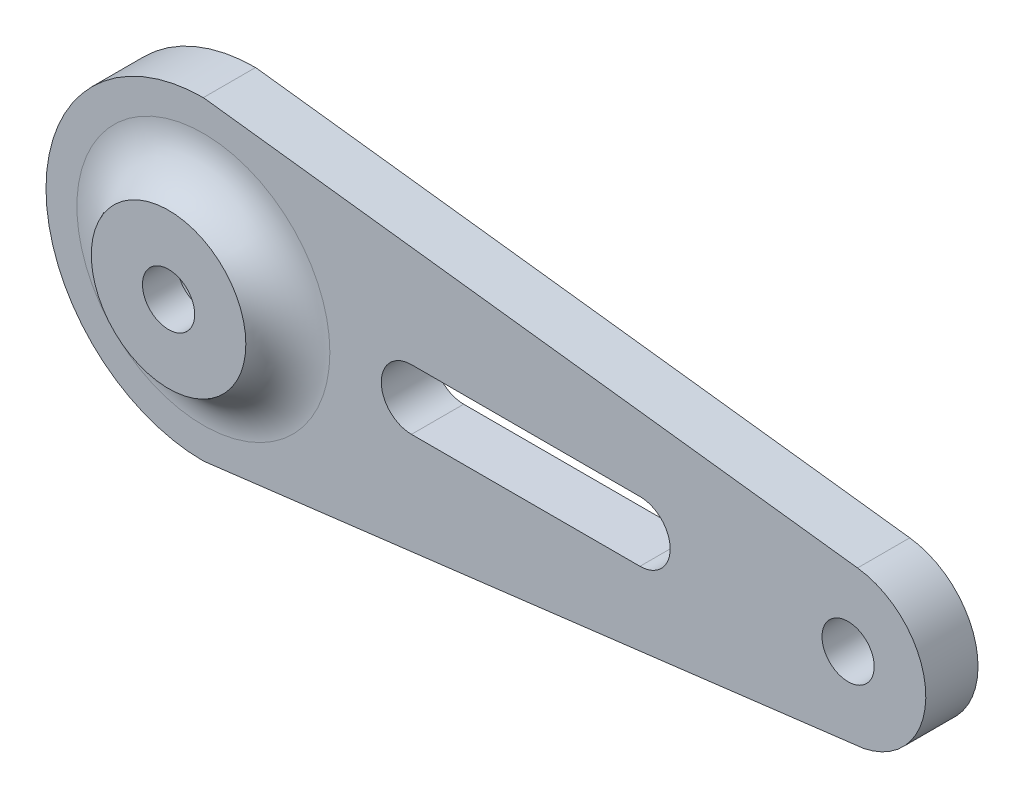
ISO-10303-21;
HEADER;
FILE_DESCRIPTION(('STEP AP214'),'2;1');
FILE_NAME('part.step','',(''),(''),'','','');
FILE_SCHEMA(('AUTOMOTIVE_DESIGN { 1 0 10303 214 1 1 1 1 }'));
ENDSEC;
DATA;
#1=APPLICATION_CONTEXT('core data for automotive mechanical design processes');
#2=APPLICATION_PROTOCOL_DEFINITION('international standard','automotive_design',2000,#1);
#3=PRODUCT_CONTEXT('',#1,'mechanical');
#4=PRODUCT('Part','Part','',(#3));
#5=PRODUCT_RELATED_PRODUCT_CATEGORY('part','',(#4));
#6=PRODUCT_DEFINITION_FORMATION('','',#4);
#7=PRODUCT_DEFINITION_CONTEXT('part definition',#1,'design');
#8=PRODUCT_DEFINITION('design','',#6,#7);
#9=PRODUCT_DEFINITION_SHAPE('','',#8);
#10=(LENGTH_UNIT() NAMED_UNIT(*) SI_UNIT(.MILLI.,.METRE.));
#11=(NAMED_UNIT(*) PLANE_ANGLE_UNIT() SI_UNIT($,.RADIAN.));
#12=(NAMED_UNIT(*) SI_UNIT($,.STERADIAN.) SOLID_ANGLE_UNIT());
#13=UNCERTAINTY_MEASURE_WITH_UNIT(LENGTH_MEASURE(1.E-05),#10,'distance_accuracy_value','');
#14=(GEOMETRIC_REPRESENTATION_CONTEXT(3) GLOBAL_UNCERTAINTY_ASSIGNED_CONTEXT((#13)) GLOBAL_UNIT_ASSIGNED_CONTEXT((#10,
#11,#12)) REPRESENTATION_CONTEXT('',''));
#15=CARTESIAN_POINT('',(0.,0.,0.));
#16=DIRECTION('',(0.,0.,1.));
#17=DIRECTION('',(1.,0.,0.));
#18=AXIS2_PLACEMENT_3D('',#15,#16,#17);
#19=CARTESIAN_POINT('',(-12.9121005284629,104.943544624177,3.));
#20=DIRECTION('',(-0.122117674057894,0.992515628936235,0.));
#21=DIRECTION('',(-0.992515628936235,-0.122117674057894,0.));
#22=AXIS2_PLACEMENT_3D('',#19,#20,#21);
#23=PLANE('',#22);
#24=DIRECTION('',(0.992515628936235,0.122117674057894,0.));
#25=VECTOR('',#24,1.);
#26=CARTESIAN_POINT('',(-12.9121005284629,104.943544624177,0.));
#27=LINE('',#26,#25);
#28=CARTESIAN_POINT('',(-70.9057277691054,97.8080933906298,0.));
#29=VERTEX_POINT('',#28);
#30=CARTESIAN_POINT('',(-32.9565694582331,102.477302429026,0.));
#31=VERTEX_POINT('',#30);
#32=EDGE_CURVE('E154',#29,#31,#27,.T.);
#33=ORIENTED_EDGE('',*,*,#32,.T.);
#34=DIRECTION('',(0.,0.,-1.));
#35=VECTOR('',#34,1.);
#36=CARTESIAN_POINT('',(-32.9565694582331,102.477302429026,3.));
#37=LINE('',#36,#35);
#38=CARTESIAN_POINT('',(-32.9565694582331,102.477302429026,3.));
#39=VERTEX_POINT('',#38);
#40=EDGE_CURVE('E49',#39,#31,#37,.T.);
#41=ORIENTED_EDGE('',*,*,#40,.F.);
#42=DIRECTION('',(0.992515628936235,0.122117674057894,0.));
#43=VECTOR('',#42,1.);
#44=CARTESIAN_POINT('',(-12.9121005284629,104.943544624177,3.));
#45=LINE('',#44,#43);
#46=CARTESIAN_POINT('',(-70.9057277691054,97.8080933906298,3.));
#47=VERTEX_POINT('',#46);
#48=EDGE_CURVE('E116',#47,#39,#45,.T.);
#49=ORIENTED_EDGE('',*,*,#48,.F.);
#50=DIRECTION('',(0.,0.,-1.));
#51=VECTOR('',#50,1.);
#52=CARTESIAN_POINT('',(-70.9057277691054,97.8080933906298,3.));
#53=LINE('',#52,#51);
#54=EDGE_CURVE('E162',#47,#29,#53,.T.);
#55=ORIENTED_EDGE('',*,*,#54,.T.);
#56=EDGE_LOOP('',(#33,#41,#49,#55));
#57=FACE_BOUND('',#56,.T.);
#58=ADVANCED_FACE('F40',(#57),#23,.F.);
#59=CARTESIAN_POINT('',(-33.8600208407276,106.850502785429,3.));
#60=DIRECTION('',(0.,0.,-1.));
#61=DIRECTION('',(-1.,0.,0.));
#62=AXIS2_PLACEMENT_3D('',#59,#60,#61);
#63=CYLINDRICAL_SURFACE('',#62,4.46554652397416);
#64=CARTESIAN_POINT('',(-33.8600208407276,106.850502785429,0.));
#65=DIRECTION('',(0.,0.,1.));
#66=DIRECTION('',(1.,0.,0.));
#67=AXIS2_PLACEMENT_3D('',#64,#65,#66);
#68=CIRCLE('',#67,4.46554652397416);
#69=CARTESIAN_POINT('',(-33.3164248488343,111.282839545579,0.));
#70=VERTEX_POINT('',#69);
#71=EDGE_CURVE('E124',#31,#70,#68,.T.);
#72=ORIENTED_EDGE('',*,*,#71,.T.);
#73=DIRECTION('',(0.,0.,-1.));
#74=VECTOR('',#73,1.);
#75=CARTESIAN_POINT('',(-33.3164248488343,111.282839545579,3.));
#76=LINE('',#75,#74);
#77=CARTESIAN_POINT('',(-33.3164248488343,111.282839545579,3.));
#78=VERTEX_POINT('',#77);
#79=EDGE_CURVE('E122',#78,#70,#76,.T.);
#80=ORIENTED_EDGE('',*,*,#79,.F.);
#81=CARTESIAN_POINT('',(-33.8600208407276,106.850502785429,3.));
#82=DIRECTION('',(0.,0.,1.));
#83=DIRECTION('',(1.,0.,0.));
#84=AXIS2_PLACEMENT_3D('',#81,#82,#83);
#85=CIRCLE('',#84,4.46554652397416);
#86=EDGE_CURVE('E110',#39,#78,#85,.T.);
#87=ORIENTED_EDGE('',*,*,#86,.F.);
#88=ORIENTED_EDGE('',*,*,#40,.T.);
#89=EDGE_LOOP('',(#72,#80,#87,#88));
#90=FACE_BOUND('',#89,.T.);
#91=ADVANCED_FACE('F123',(#90),#63,.T.);
#92=CARTESIAN_POINT('',(12.95214226126,105.60831412192,3.));
#93=DIRECTION('',(0.1217311227136,0.992563113239096,0.));
#94=DIRECTION('',(-0.992563113239096,0.1217311227136,0.));
#95=AXIS2_PLACEMENT_3D('',#92,#93,#94);
#96=PLANE('',#95);
#97=DIRECTION('',(0.992563113239096,-0.1217311227136,0.));
#98=VECTOR('',#97,1.);
#99=CARTESIAN_POINT('',(12.95214226126,105.60831412192,0.));
#100=LINE('',#99,#98);
#101=CARTESIAN_POINT('',(-70.9057277691054,115.892912180229,0.));
#102=VERTEX_POINT('',#101);
#103=EDGE_CURVE('E158',#102,#70,#100,.T.);
#104=ORIENTED_EDGE('',*,*,#103,.F.);
#105=DIRECTION('',(0.,0.,-1.));
#106=VECTOR('',#105,1.);
#107=CARTESIAN_POINT('',(-70.9057277691054,115.892912180229,3.));
#108=LINE('',#107,#106);
#109=CARTESIAN_POINT('',(-70.9057277691054,115.892912180229,3.));
#110=VERTEX_POINT('',#109);
#111=EDGE_CURVE('E85',#110,#102,#108,.T.);
#112=ORIENTED_EDGE('',*,*,#111,.F.);
#113=DIRECTION('',(0.992563113239096,-0.1217311227136,0.));
#114=VECTOR('',#113,1.);
#115=CARTESIAN_POINT('',(12.95214226126,105.60831412192,3.));
#116=LINE('',#115,#114);
#117=EDGE_CURVE('E114',#110,#78,#116,.T.);
#118=ORIENTED_EDGE('',*,*,#117,.T.);
#119=ORIENTED_EDGE('',*,*,#79,.T.);
#120=EDGE_LOOP('',(#104,#112,#118,#119));
#121=FACE_BOUND('',#120,.T.);
#122=ADVANCED_FACE('F129',(#121),#96,.T.);
#123=CARTESIAN_POINT('',(-58.9483057761577,106.850502785429,3.));
#124=DIRECTION('',(0.,0.,-1.));
#125=DIRECTION('',(-1.,0.,0.));
#126=AXIS2_PLACEMENT_3D('',#123,#124,#125);
#127=CYLINDRICAL_SURFACE('',#126,1.73455382707077);
#128=CARTESIAN_POINT('',(-58.9483057761577,106.850502785429,0.));
#129=DIRECTION('',(0.,0.,1.));
#130=DIRECTION('',(1.,0.,0.));
#131=AXIS2_PLACEMENT_3D('',#128,#129,#130);
#132=CIRCLE('',#131,1.73455382707077);
#133=CARTESIAN_POINT('',(-58.9483057761577,108.5850566125,0.));
#134=VERTEX_POINT('',#133);
#135=CARTESIAN_POINT('',(-58.9483057761577,105.115948958358,0.));
#136=VERTEX_POINT('',#135);
#137=EDGE_CURVE('E135',#134,#136,#132,.T.);
#138=ORIENTED_EDGE('',*,*,#137,.F.);
#139=DIRECTION('',(0.,0.,-1.));
#140=VECTOR('',#139,1.);
#141=CARTESIAN_POINT('',(-58.9483057761577,108.5850566125,3.));
#142=LINE('',#141,#140);
#143=CARTESIAN_POINT('',(-58.9483057761577,108.5850566125,3.));
#144=VERTEX_POINT('',#143);
#145=EDGE_CURVE('E96',#144,#134,#142,.T.);
#146=ORIENTED_EDGE('',*,*,#145,.F.);
#147=CARTESIAN_POINT('',(-58.9483057761577,106.850502785429,3.));
#148=DIRECTION('',(0.,0.,1.));
#149=DIRECTION('',(1.,0.,0.));
#150=AXIS2_PLACEMENT_3D('',#147,#148,#149);
#151=CIRCLE('',#150,1.73455382707077);
#152=CARTESIAN_POINT('',(-58.9483057761577,105.115948958358,3.));
#153=VERTEX_POINT('',#152);
#154=EDGE_CURVE('E161',#144,#153,#151,.T.);
#155=ORIENTED_EDGE('',*,*,#154,.T.);
#156=DIRECTION('',(0.,0.,-1.));
#157=VECTOR('',#156,1.);
#158=CARTESIAN_POINT('',(-58.9483057761577,105.115948958358,3.));
#159=LINE('',#158,#157);
#160=EDGE_CURVE('E131',#153,#136,#159,.T.);
#161=ORIENTED_EDGE('',*,*,#160,.T.);
#162=EDGE_LOOP('',(#138,#146,#155,#161));
#163=FACE_BOUND('',#162,.T.);
#164=ADVANCED_FACE('F176',(#163),#127,.F.);
#165=CARTESIAN_POINT('',(0.,108.5850566125,3.));
#166=DIRECTION('',(0.,-1.,0.));
#167=DIRECTION('',(0.,0.,-1.));
#168=AXIS2_PLACEMENT_3D('',#165,#166,#167);
#169=PLANE('',#168);
#170=DIRECTION('',(-1.,0.,0.));
#171=VECTOR('',#170,1.);
#172=CARTESIAN_POINT('',(0.,108.5850566125,0.));
#173=LINE('',#172,#171);
#174=CARTESIAN_POINT('',(-45.8174428336752,108.5850566125,0.));
#175=VERTEX_POINT('',#174);
#176=EDGE_CURVE('E138',#175,#134,#173,.T.);
#177=ORIENTED_EDGE('',*,*,#176,.F.);
#178=DIRECTION('',(0.,0.,-1.));
#179=VECTOR('',#178,1.);
#180=CARTESIAN_POINT('',(-45.8174428336752,108.5850566125,3.));
#181=LINE('',#180,#179);
#182=CARTESIAN_POINT('',(-45.8174428336752,108.5850566125,3.));
#183=VERTEX_POINT('',#182);
#184=EDGE_CURVE('E169',#183,#175,#181,.T.);
#185=ORIENTED_EDGE('',*,*,#184,.F.);
#186=DIRECTION('',(-1.,0.,0.));
#187=VECTOR('',#186,1.);
#188=CARTESIAN_POINT('',(0.,108.5850566125,3.));
#189=LINE('',#188,#187);
#190=EDGE_CURVE('E175',#183,#144,#189,.T.);
#191=ORIENTED_EDGE('',*,*,#190,.T.);
#192=ORIENTED_EDGE('',*,*,#145,.T.);
#193=EDGE_LOOP('',(#177,#185,#191,#192));
#194=FACE_BOUND('',#193,.T.);
#195=ADVANCED_FACE('F173',(#194),#169,.T.);
#196=CARTESIAN_POINT('',(-45.8174428336752,106.850502785429,3.));
#197=DIRECTION('',(0.,0.,-1.));
#198=DIRECTION('',(-1.,0.,0.));
#199=AXIS2_PLACEMENT_3D('',#196,#197,#198);
#200=CYLINDRICAL_SURFACE('',#199,1.73455382707077);
#201=CARTESIAN_POINT('',(-45.8174428336752,106.850502785429,0.));
#202=DIRECTION('',(0.,0.,1.));
#203=DIRECTION('',(1.,0.,0.));
#204=AXIS2_PLACEMENT_3D('',#201,#202,#203);
#205=CIRCLE('',#204,1.73455382707077);
#206=CARTESIAN_POINT('',(-45.8174428336752,105.115948958358,0.));
#207=VERTEX_POINT('',#206);
#208=EDGE_CURVE('E142',#207,#175,#205,.T.);
#209=ORIENTED_EDGE('',*,*,#208,.F.);
#210=DIRECTION('',(0.,0.,-1.));
#211=VECTOR('',#210,1.);
#212=CARTESIAN_POINT('',(-45.8174428336752,105.115948958358,3.));
#213=LINE('',#212,#211);
#214=CARTESIAN_POINT('',(-45.8174428336752,105.115948958358,3.));
#215=VERTEX_POINT('',#214);
#216=EDGE_CURVE('E167',#215,#207,#213,.T.);
#217=ORIENTED_EDGE('',*,*,#216,.F.);
#218=CARTESIAN_POINT('',(-45.8174428336752,106.850502785429,3.));
#219=DIRECTION('',(0.,0.,1.));
#220=DIRECTION('',(1.,0.,0.));
#221=AXIS2_PLACEMENT_3D('',#218,#219,#220);
#222=CIRCLE('',#221,1.73455382707077);
#223=EDGE_CURVE('E188',#215,#183,#222,.T.);
#224=ORIENTED_EDGE('',*,*,#223,.T.);
#225=ORIENTED_EDGE('',*,*,#184,.T.);
#226=EDGE_LOOP('',(#209,#217,#224,#225));
#227=FACE_BOUND('',#226,.T.);
#228=ADVANCED_FACE('F184',(#227),#200,.F.);
#229=CARTESIAN_POINT('',(-33.8600208407276,106.850502785429,3.));
#230=DIRECTION('',(0.,0.,-1.));
#231=DIRECTION('',(-1.,0.,0.));
#232=AXIS2_PLACEMENT_3D('',#229,#230,#231);
#233=CYLINDRICAL_SURFACE('',#232,1.5);
#234=CARTESIAN_POINT('',(-33.8600208407276,106.850502785429,3.));
#235=DIRECTION('',(0.,0.,1.));
#236=DIRECTION('',(1.,0.,0.));
#237=AXIS2_PLACEMENT_3D('',#234,#235,#236);
#238=CIRCLE('',#237,1.5);
#239=CARTESIAN_POINT('',(-32.3600208407275,106.850502785429,3.));
#240=VERTEX_POINT('',#239);
#241=EDGE_CURVE('E198',#240,#240,#238,.T.);
#242=ORIENTED_EDGE('',*,*,#241,.T.);
#243=EDGE_LOOP('',(#242));
#244=FACE_BOUND('',#243,.T.);
#245=CARTESIAN_POINT('',(-33.8600208407276,106.850502785429,0.));
#246=DIRECTION('',(0.,0.,1.));
#247=DIRECTION('',(1.,0.,0.));
#248=AXIS2_PLACEMENT_3D('',#245,#246,#247);
#249=CIRCLE('',#248,1.5);
#250=CARTESIAN_POINT('',(-32.3600208407275,106.850502785429,0.));
#251=VERTEX_POINT('',#250);
#252=EDGE_CURVE('E151',#251,#251,#249,.T.);
#253=ORIENTED_EDGE('',*,*,#252,.F.);
#254=EDGE_LOOP('',(#253));
#255=FACE_BOUND('',#254,.T.);
#256=ADVANCED_FACE('F202',(#244,#255),#233,.F.);
#257=CARTESIAN_POINT('',(-70.9057277691054,106.850502785429,3.));
#258=DIRECTION('',(0.,0.,-1.));
#259=DIRECTION('',(-1.,0.,0.));
#260=AXIS2_PLACEMENT_3D('',#257,#258,#259);
#261=CYLINDRICAL_SURFACE('',#260,3.00000000000001);
#262=CARTESIAN_POINT('',(-70.9057277691054,106.850502785429,3.));
#263=DIRECTION('',(0.,0.,1.));
#264=DIRECTION('',(1.,0.,0.));
#265=AXIS2_PLACEMENT_3D('',#262,#263,#264);
#266=CIRCLE('',#265,3.00000000000001);
#267=CARTESIAN_POINT('',(-67.9057277691054,106.850502785429,3.));
#268=VERTEX_POINT('',#267);
#269=EDGE_CURVE('E139',#268,#268,#266,.T.);
#270=ORIENTED_EDGE('',*,*,#269,.T.);
#271=EDGE_LOOP('',(#270));
#272=FACE_BOUND('',#271,.T.);
#273=CARTESIAN_POINT('',(-70.9057277691054,106.850502785429,0.));
#274=DIRECTION('',(0.,0.,1.));
#275=DIRECTION('',(1.,0.,0.));
#276=AXIS2_PLACEMENT_3D('',#273,#274,#275);
#277=CIRCLE('',#276,3.00000000000001);
#278=CARTESIAN_POINT('',(-67.9057277691054,106.850502785429,0.));
#279=VERTEX_POINT('',#278);
#280=EDGE_CURVE('E148',#279,#279,#277,.T.);
#281=ORIENTED_EDGE('',*,*,#280,.F.);
#282=EDGE_LOOP('',(#281));
#283=FACE_BOUND('',#282,.T.);
#284=ADVANCED_FACE('F228',(#272,#283),#261,.F.);
#285=CARTESIAN_POINT('',(0.,105.115948958358,3.));
#286=DIRECTION('',(0.,-1.,0.));
#287=DIRECTION('',(0.,0.,-1.));
#288=AXIS2_PLACEMENT_3D('',#285,#286,#287);
#289=PLANE('',#288);
#290=DIRECTION('',(-1.,0.,0.));
#291=VECTOR('',#290,1.);
#292=CARTESIAN_POINT('',(0.,105.115948958358,0.));
#293=LINE('',#292,#291);
#294=EDGE_CURVE('E145',#207,#136,#293,.T.);
#295=ORIENTED_EDGE('',*,*,#294,.T.);
#296=ORIENTED_EDGE('',*,*,#160,.F.);
#297=DIRECTION('',(-1.,0.,0.));
#298=VECTOR('',#297,1.);
#299=CARTESIAN_POINT('',(0.,105.115948958358,3.));
#300=LINE('',#299,#298);
#301=EDGE_CURVE('E192',#215,#153,#300,.T.);
#302=ORIENTED_EDGE('',*,*,#301,.F.);
#303=ORIENTED_EDGE('',*,*,#216,.T.);
#304=EDGE_LOOP('',(#295,#296,#302,#303));
#305=FACE_BOUND('',#304,.T.);
#306=ADVANCED_FACE('F214',(#305),#289,.F.);
#307=CARTESIAN_POINT('',(-70.9057277691054,106.850502785429,3.));
#308=DIRECTION('',(0.,0.,-1.));
#309=DIRECTION('',(-1.,0.,0.));
#310=AXIS2_PLACEMENT_3D('',#307,#308,#309);
#311=CYLINDRICAL_SURFACE('',#310,9.0424093947995);
#312=CARTESIAN_POINT('',(-70.9057277691054,106.850502785429,0.));
#313=DIRECTION('',(0.,0.,1.));
#314=DIRECTION('',(1.,0.,0.));
#315=AXIS2_PLACEMENT_3D('',#312,#313,#314);
#316=CIRCLE('',#315,9.0424093947995);
#317=EDGE_CURVE('E88',#102,#29,#316,.T.);
#318=ORIENTED_EDGE('',*,*,#317,.T.);
#319=ORIENTED_EDGE('',*,*,#54,.F.);
#320=CARTESIAN_POINT('',(-70.9057277691054,106.850502785429,3.));
#321=DIRECTION('',(0.,0.,1.));
#322=DIRECTION('',(1.,0.,0.));
#323=AXIS2_PLACEMENT_3D('',#320,#321,#322);
#324=CIRCLE('',#323,9.0424093947995);
#325=EDGE_CURVE('E57',#110,#47,#324,.T.);
#326=ORIENTED_EDGE('',*,*,#325,.F.);
#327=ORIENTED_EDGE('',*,*,#111,.T.);
#328=EDGE_LOOP('',(#318,#319,#326,#327));
#329=FACE_BOUND('',#328,.T.);
#330=ADVANCED_FACE('F205',(#329),#311,.T.);
#331=CARTESIAN_POINT('',(0.,0.,3.));
#332=DIRECTION('',(0.,0.,1.));
#333=DIRECTION('',(1.,0.,0.));
#334=AXIS2_PLACEMENT_3D('',#331,#332,#333);
#335=PLANE('',#334);
#336=CARTESIAN_POINT('',(-70.9057277691067,106.850502785428,3.));
#337=DIRECTION('',(0.,0.,1.));
#338=DIRECTION('',(1.,0.,0.));
#339=AXIS2_PLACEMENT_3D('',#336,#337,#338);
#340=CIRCLE('',#339,7.26865870997795);
#341=CARTESIAN_POINT('',(-63.6370690591288,106.850502785428,3.));
#342=VERTEX_POINT('',#341);
#343=EDGE_CURVE('E11',#342,#342,#340,.F.);
#344=ORIENTED_EDGE('',*,*,#343,.T.);
#345=EDGE_LOOP('',(#344));
#346=FACE_BOUND('',#345,.T.);
#347=ORIENTED_EDGE('',*,*,#154,.F.);
#348=ORIENTED_EDGE('',*,*,#190,.F.);
#349=ORIENTED_EDGE('',*,*,#223,.F.);
#350=ORIENTED_EDGE('',*,*,#301,.T.);
#351=EDGE_LOOP('',(#347,#348,#349,#350));
#352=FACE_BOUND('',#351,.T.);
#353=ORIENTED_EDGE('',*,*,#241,.F.);
#354=EDGE_LOOP('',(#353));
#355=FACE_BOUND('',#354,.T.);
#356=ORIENTED_EDGE('',*,*,#48,.T.);
#357=ORIENTED_EDGE('',*,*,#86,.T.);
#358=ORIENTED_EDGE('',*,*,#117,.F.);
#359=ORIENTED_EDGE('',*,*,#325,.T.);
#360=EDGE_LOOP('',(#356,#357,#358,#359));
#361=FACE_BOUND('',#360,.T.);
#362=ADVANCED_FACE('F112',(#346,#352,#355,#361),#335,.T.);
#363=CARTESIAN_POINT('',(0.,0.,0.));
#364=DIRECTION('',(0.,0.,1.));
#365=DIRECTION('',(1.,0.,0.));
#366=AXIS2_PLACEMENT_3D('',#363,#364,#365);
#367=PLANE('',#366);
#368=ORIENTED_EDGE('',*,*,#137,.T.);
#369=ORIENTED_EDGE('',*,*,#294,.F.);
#370=ORIENTED_EDGE('',*,*,#208,.T.);
#371=ORIENTED_EDGE('',*,*,#176,.T.);
#372=EDGE_LOOP('',(#368,#369,#370,#371));
#373=FACE_BOUND('',#372,.T.);
#374=ORIENTED_EDGE('',*,*,#280,.T.);
#375=EDGE_LOOP('',(#374));
#376=FACE_BOUND('',#375,.T.);
#377=ORIENTED_EDGE('',*,*,#252,.T.);
#378=EDGE_LOOP('',(#377));
#379=FACE_BOUND('',#378,.T.);
#380=ORIENTED_EDGE('',*,*,#32,.F.);
#381=ORIENTED_EDGE('',*,*,#317,.F.);
#382=ORIENTED_EDGE('',*,*,#103,.T.);
#383=ORIENTED_EDGE('',*,*,#71,.F.);
#384=EDGE_LOOP('',(#380,#381,#382,#383));
#385=FACE_BOUND('',#384,.T.);
#386=ADVANCED_FACE('F180',(#373,#376,#379,#385),#367,.F.);
#387=CARTESIAN_POINT('',(-70.9057277691067,106.850502785428,3.));
#388=DIRECTION('',(0.,0.,1.));
#389=DIRECTION('',(1.,0.,0.));
#390=AXIS2_PLACEMENT_3D('',#387,#388,#389);
#391=PLANE('',#390);
#392=CARTESIAN_POINT('',(-70.9057277691067,106.850502785428,3.));
#393=DIRECTION('',(0.,0.,1.));
#394=DIRECTION('',(1.,0.,0.));
#395=AXIS2_PLACEMENT_3D('',#392,#393,#394);
#396=CIRCLE('',#395,1.49999999999856);
#397=CARTESIAN_POINT('',(-69.4057277691082,106.850502785428,3.));
#398=VERTEX_POINT('',#397);
#399=EDGE_CURVE('E385',#398,#398,#396,.T.);
#400=ORIENTED_EDGE('',*,*,#399,.T.);
#401=EDGE_LOOP('',(#400));
#402=FACE_BOUND('',#401,.T.);
#403=ORIENTED_EDGE('',*,*,#269,.F.);
#404=EDGE_LOOP('',(#403));
#405=FACE_BOUND('',#404,.T.);
#406=ADVANCED_FACE('F212',(#402,#405),#391,.F.);
#407=CARTESIAN_POINT('',(-70.9057277691067,106.850502785428,5.));
#408=DIRECTION('',(0.,0.,1.));
#409=DIRECTION('',(1.,0.,0.));
#410=AXIS2_PLACEMENT_3D('',#407,#408,#409);
#411=PLANE('',#410);
#412=CARTESIAN_POINT('',(-70.9057277691067,106.850502785428,5.));
#413=DIRECTION('',(0.,0.,1.));
#414=DIRECTION('',(1.,0.,0.));
#415=AXIS2_PLACEMENT_3D('',#412,#413,#414);
#416=CIRCLE('',#415,4.44023158523176);
#417=CARTESIAN_POINT('',(-66.465496183875,106.850502785428,5.));
#418=VERTEX_POINT('',#417);
#419=EDGE_CURVE('E380',#418,#418,#416,.T.);
#420=ORIENTED_EDGE('',*,*,#419,.T.);
#421=EDGE_LOOP('',(#420));
#422=FACE_BOUND('',#421,.T.);
#423=CARTESIAN_POINT('',(-70.9057277691067,106.850502785428,5.));
#424=DIRECTION('',(0.,0.,1.));
#425=DIRECTION('',(1.,0.,0.));
#426=AXIS2_PLACEMENT_3D('',#423,#424,#425);
#427=CIRCLE('',#426,1.49999999999856);
#428=CARTESIAN_POINT('',(-69.4057277691082,106.850502785428,5.));
#429=VERTEX_POINT('',#428);
#430=EDGE_CURVE('E381',#429,#429,#427,.T.);
#431=ORIENTED_EDGE('',*,*,#430,.F.);
#432=EDGE_LOOP('',(#431));
#433=FACE_BOUND('',#432,.T.);
#434=ADVANCED_FACE('F321',(#422,#433),#411,.T.);
#435=CARTESIAN_POINT('',(-70.9057277691067,106.850502785428,5.));
#436=DIRECTION('',(0.,0.,-1.));
#437=DIRECTION('',(-1.,0.,0.));
#438=AXIS2_PLACEMENT_3D('',#435,#436,#437);
#439=CYLINDRICAL_SURFACE('',#438,1.49999999999856);
#440=ORIENTED_EDGE('',*,*,#430,.T.);
#441=EDGE_LOOP('',(#440));
#442=FACE_BOUND('',#441,.T.);
#443=ORIENTED_EDGE('',*,*,#399,.F.);
#444=EDGE_LOOP('',(#443));
#445=FACE_BOUND('',#444,.T.);
#446=ADVANCED_FACE('F330',(#442,#445),#439,.F.);
#447=CARTESIAN_POINT('',(-70.9057277691067,106.850502785428,6.));
#448=DIRECTION('',(0.,0.,1.));
#449=DIRECTION('',(1.,0.,0.));
#450=AXIS2_PLACEMENT_3D('',#447,#448,#449);
#451=TOROIDAL_SURFACE('',#450,7.26865870997795,3.);
#452=ORIENTED_EDGE('',*,*,#343,.F.);
#453=EDGE_LOOP('',(#452));
#454=FACE_BOUND('',#453,.T.);
#455=ORIENTED_EDGE('',*,*,#419,.F.);
#456=EDGE_LOOP('',(#455));
#457=FACE_BOUND('',#456,.T.);
#458=ADVANCED_FACE('F42',(#454,#457),#451,.F.);
#459=CLOSED_SHELL('',(#58,#91,#122,#164,#195,#228,#256,#284,#306,#330,#362,#386,#406,#434,#446,#458));
#460=MANIFOLD_SOLID_BREP('B2',#459);
#461=ADVANCED_BREP_SHAPE_REPRESENTATION('',(#18,#460),#14);
#462=SHAPE_DEFINITION_REPRESENTATION(#9,#461);
ENDSEC;
END-ISO-10303-21;
